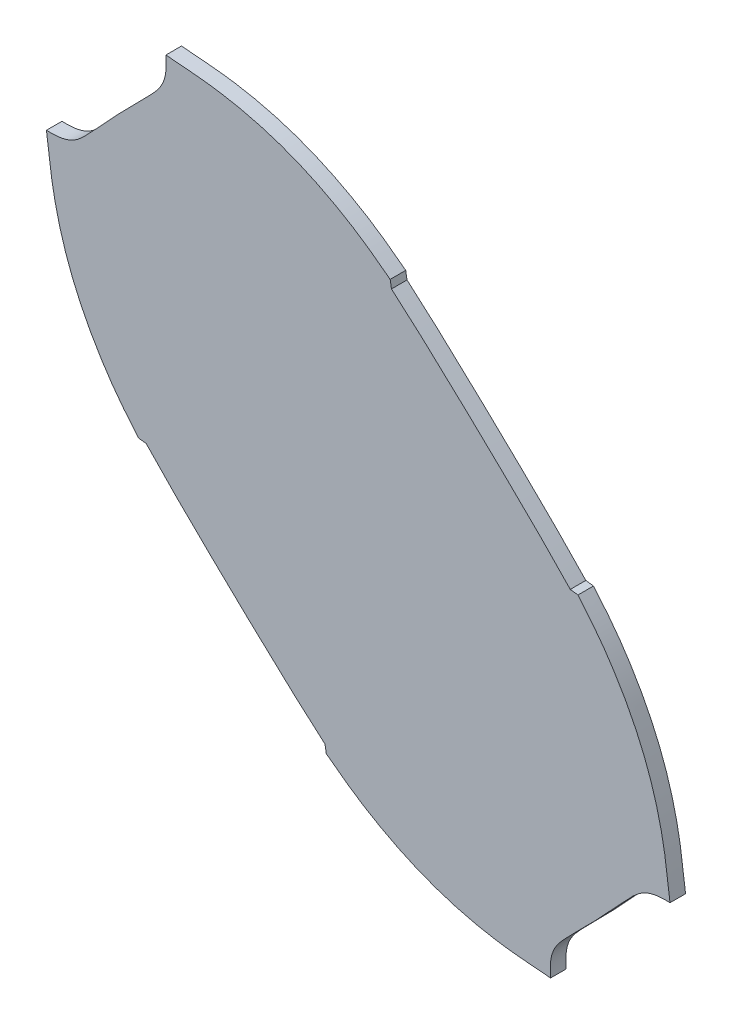
ISO-10303-21;
HEADER;
FILE_DESCRIPTION(('STEP AP214'),'2;1');
FILE_NAME('part.step','',(''),(''),'','','');
FILE_SCHEMA(('AUTOMOTIVE_DESIGN { 1 0 10303 214 1 1 1 1 }'));
ENDSEC;
DATA;
#1=APPLICATION_CONTEXT('core data for automotive mechanical design processes');
#2=APPLICATION_PROTOCOL_DEFINITION('international standard','automotive_design',2000,#1);
#3=PRODUCT_CONTEXT('',#1,'mechanical');
#4=PRODUCT('Part','Part','',(#3));
#5=PRODUCT_RELATED_PRODUCT_CATEGORY('part','',(#4));
#6=PRODUCT_DEFINITION_FORMATION('','',#4);
#7=PRODUCT_DEFINITION_CONTEXT('part definition',#1,'design');
#8=PRODUCT_DEFINITION('design','',#6,#7);
#9=PRODUCT_DEFINITION_SHAPE('','',#8);
#10=(LENGTH_UNIT() NAMED_UNIT(*) SI_UNIT(.MILLI.,.METRE.));
#11=(NAMED_UNIT(*) PLANE_ANGLE_UNIT() SI_UNIT($,.RADIAN.));
#12=(NAMED_UNIT(*) SI_UNIT($,.STERADIAN.) SOLID_ANGLE_UNIT());
#13=UNCERTAINTY_MEASURE_WITH_UNIT(LENGTH_MEASURE(1.E-05),#10,'distance_accuracy_value','');
#14=(GEOMETRIC_REPRESENTATION_CONTEXT(3) GLOBAL_UNCERTAINTY_ASSIGNED_CONTEXT((#13)) GLOBAL_UNIT_ASSIGNED_CONTEXT((#10,
#11,#12)) REPRESENTATION_CONTEXT('',''));
#15=CARTESIAN_POINT('',(0.,0.,0.));
#16=DIRECTION('',(0.,0.,1.));
#17=DIRECTION('',(1.,0.,0.));
#18=AXIS2_PLACEMENT_3D('',#15,#16,#17);
#19=CARTESIAN_POINT('',(2.67986765131261,-45.5572970029927,3.));
#20=DIRECTION('',(0.985966661338365,0.166942333544487,0.));
#21=DIRECTION('',(-0.166942333544487,0.985966661338365,0.));
#22=AXIS2_PLACEMENT_3D('',#19,#20,#21);
#23=PLANE('',#22);
#24=CARTESIAN_POINT('',(2.67986765131261,-45.5572970029927,0.));
#25=CARTESIAN_POINT('',(2.76331527435811,-46.0501412836728,0.));
#26=CARTESIAN_POINT('',(2.84676289740361,-46.5429855643529,0.));
#27=CARTESIAN_POINT('',(2.9302105204491,-47.035829845033,0.));
#28=B_SPLINE_CURVE_WITH_KNOTS('',3,(#24,#25,#26,#27),.UNSPECIFIED.,.F.,.F.,(4,4),(0.,1.),.UNSPECIFIED.);
#29=CARTESIAN_POINT('',(2.67986765131261,-45.5572970029927,0.));
#30=VERTEX_POINT('',#29);
#31=CARTESIAN_POINT('',(2.9302105204491,-47.035829845033,0.));
#32=VERTEX_POINT('',#31);
#33=EDGE_CURVE('E194',#30,#32,#28,.T.);
#34=ORIENTED_EDGE('',*,*,#33,.T.);
#35=DIRECTION('',(0.,0.,-1.));
#36=VECTOR('',#35,1.);
#37=CARTESIAN_POINT('',(2.9302105204491,-47.035829845033,3.));
#38=LINE('',#37,#36);
#39=CARTESIAN_POINT('',(2.9302105204491,-47.035829845033,3.));
#40=VERTEX_POINT('',#39);
#41=EDGE_CURVE('E11',#40,#32,#38,.T.);
#42=ORIENTED_EDGE('',*,*,#41,.F.);
#43=CARTESIAN_POINT('',(2.67986765131261,-45.5572970029927,3.));
#44=CARTESIAN_POINT('',(2.76331527435811,-46.0501412836728,3.));
#45=CARTESIAN_POINT('',(2.84676289740361,-46.5429855643529,3.));
#46=CARTESIAN_POINT('',(2.9302105204491,-47.035829845033,3.));
#47=B_SPLINE_CURVE_WITH_KNOTS('',3,(#43,#44,#45,#46),.UNSPECIFIED.,.F.,.F.,(4,4),(0.,1.),.UNSPECIFIED.);
#48=CARTESIAN_POINT('',(2.67986765131261,-45.5572970029927,3.));
#49=VERTEX_POINT('',#48);
#50=EDGE_CURVE('E435',#49,#40,#47,.T.);
#51=ORIENTED_EDGE('',*,*,#50,.F.);
#52=DIRECTION('',(0.,0.,-1.));
#53=VECTOR('',#52,1.);
#54=CARTESIAN_POINT('',(2.67986765131261,-45.5572970029927,3.));
#55=LINE('',#54,#53);
#56=EDGE_CURVE('E179',#49,#30,#55,.T.);
#57=ORIENTED_EDGE('',*,*,#56,.T.);
#58=EDGE_LOOP('',(#34,#42,#51,#57));
#59=FACE_BOUND('',#58,.T.);
#60=ADVANCED_FACE('F39',(#59),#23,.F.);
#61=CARTESIAN_POINT('',(2.9302105204491,-47.035829845033,3.));
#62=CARTESIAN_POINT('',(7.06739263392164,-50.2034087988623,3.));
#63=CARTESIAN_POINT('',(9.19210977284867,-51.6619495338041,3.));
#64=CARTESIAN_POINT('',(16.0339125247366,-55.5964176445261,3.));
#65=CARTESIAN_POINT('',(19.5317828946011,-57.2473779633906,3.));
#66=CARTESIAN_POINT('',(26.9017065758255,-59.9461433438054,3.));
#67=CARTESIAN_POINT('',(30.7298333587905,-60.9542798807845,3.));
#68=CARTESIAN_POINT('',(38.3297097036165,-62.2705019579,3.));
#69=CARTESIAN_POINT('',(40.9876039866022,-62.444811680781,3.));
#70=CARTESIAN_POINT('',(46.1803994232173,-62.8727567140036,3.));
#71=B_SPLINE_CURVE_WITH_KNOTS('',3,(#61,#62,#63,#64,#65,#66,#67,#68,#69,#70),.UNSPECIFIED.,.F.,
.F.,(4,2,2,2,4),(0.,0.25,0.5,0.75,1.),.UNSPECIFIED.);
#72=DIRECTION('',(0.,0.,-1.));
#73=VECTOR('',#72,1.);
#74=SURFACE_OF_LINEAR_EXTRUSION('',#71,#73);
#75=CARTESIAN_POINT('',(2.9302105204491,-47.035829845033,0.));
#76=CARTESIAN_POINT('',(7.06739263392164,-50.2034087988623,0.));
#77=CARTESIAN_POINT('',(9.19210977284867,-51.6619495338041,0.));
#78=CARTESIAN_POINT('',(16.0339125247366,-55.5964176445261,0.));
#79=CARTESIAN_POINT('',(19.5317828946011,-57.2473779633906,0.));
#80=CARTESIAN_POINT('',(26.9017065758255,-59.9461433438054,0.));
#81=CARTESIAN_POINT('',(30.7298333587905,-60.9542798807845,0.));
#82=CARTESIAN_POINT('',(38.3297097036165,-62.2705019579,0.));
#83=CARTESIAN_POINT('',(40.9876039866022,-62.444811680781,0.));
#84=CARTESIAN_POINT('',(46.1803994232173,-62.8727567140036,0.));
#85=B_SPLINE_CURVE_WITH_KNOTS('',3,(#75,#76,#77,#78,#79,#80,#81,#82,#83,#84),.UNSPECIFIED.,.F.,
.F.,(4,2,2,2,4),(0.,0.25,0.5,0.75,1.),.UNSPECIFIED.);
#86=CARTESIAN_POINT('',(46.1803994232173,-62.8727567140036,0.));
#87=VERTEX_POINT('',#86);
#88=EDGE_CURVE('E343',#32,#87,#85,.T.);
#89=ORIENTED_EDGE('',*,*,#88,.T.);
#90=DIRECTION('',(0.,0.,-1.));
#91=VECTOR('',#90,1.);
#92=CARTESIAN_POINT('',(46.1803994232173,-62.8727567140036,3.));
#93=LINE('',#92,#91);
#94=CARTESIAN_POINT('',(46.1803994232173,-62.8727567140036,3.));
#95=VERTEX_POINT('',#94);
#96=EDGE_CURVE('E47',#95,#87,#93,.T.);
#97=ORIENTED_EDGE('',*,*,#96,.F.);
#98=EDGE_CURVE('E122',#40,#95,#71,.T.);
#99=ORIENTED_EDGE('',*,*,#98,.F.);
#100=ORIENTED_EDGE('',*,*,#41,.T.);
#101=EDGE_LOOP('',(#89,#97,#99,#100));
#102=FACE_BOUND('',#101,.T.);
#103=ADVANCED_FACE('F461',(#102),#74,.F.);
#104=CARTESIAN_POINT('',(46.1803994232173,-62.8727567140036,3.));
#105=CARTESIAN_POINT('',(45.7588192219918,-57.6953537971166,3.));
#106=CARTESIAN_POINT('',(47.4255920559453,-56.517371281402,3.));
#107=CARTESIAN_POINT('',(51.0124658441758,-52.8226484741238,3.));
#108=B_SPLINE_CURVE_WITH_KNOTS('',3,(#104,#105,#106,#107),.UNSPECIFIED.,.F.,.F.,(4,4),(0.,1.),.UNSPECIFIED.);
#109=DIRECTION('',(0.,0.,-1.));
#110=VECTOR('',#109,1.);
#111=SURFACE_OF_LINEAR_EXTRUSION('',#108,#110);
#112=CARTESIAN_POINT('',(46.1803994232173,-62.8727567140036,0.));
#113=CARTESIAN_POINT('',(45.7588192219918,-57.6953537971166,0.));
#114=CARTESIAN_POINT('',(47.4255920559453,-56.517371281402,0.));
#115=CARTESIAN_POINT('',(51.0124658441758,-52.8226484741238,0.));
#116=B_SPLINE_CURVE_WITH_KNOTS('',3,(#112,#113,#114,#115),.UNSPECIFIED.,.F.,.F.,(4,4),(0.,1.),.UNSPECIFIED.);
#117=CARTESIAN_POINT('',(51.0124658441758,-52.8226484741238,0.));
#118=VERTEX_POINT('',#117);
#119=EDGE_CURVE('E338',#87,#118,#116,.T.);
#120=ORIENTED_EDGE('',*,*,#119,.T.);
#121=DIRECTION('',(0.,0.,-1.));
#122=VECTOR('',#121,1.);
#123=CARTESIAN_POINT('',(51.0124658441758,-52.8226484741238,3.));
#124=LINE('',#123,#122);
#125=CARTESIAN_POINT('',(51.0124658441758,-52.8226484741238,3.));
#126=VERTEX_POINT('',#125);
#127=EDGE_CURVE('E330',#126,#118,#124,.T.);
#128=ORIENTED_EDGE('',*,*,#127,.F.);
#129=EDGE_CURVE('E339',#95,#126,#108,.T.);
#130=ORIENTED_EDGE('',*,*,#129,.F.);
#131=ORIENTED_EDGE('',*,*,#96,.T.);
#132=EDGE_LOOP('',(#120,#128,#130,#131));
#133=FACE_BOUND('',#132,.T.);
#134=ADVANCED_FACE('F336',(#133),#111,.F.);
#135=CARTESIAN_POINT('',(51.0124658441758,-52.8226484741238,3.));
#136=CARTESIAN_POINT('',(54.8190457509373,-49.0037188838529,3.));
#137=CARTESIAN_POINT('',(55.7498454613234,-48.0270230841464,3.));
#138=CARTESIAN_POINT('',(59.3943023626721,-44.053029206688,3.));
#139=B_SPLINE_CURVE_WITH_KNOTS('',3,(#135,#136,#137,#138),.UNSPECIFIED.,.F.,.F.,(4,4),(0.,1.),.UNSPECIFIED.);
#140=DIRECTION('',(0.,0.,-1.));
#141=VECTOR('',#140,1.);
#142=SURFACE_OF_LINEAR_EXTRUSION('',#139,#141);
#143=CARTESIAN_POINT('',(51.0124658441758,-52.8226484741238,0.));
#144=CARTESIAN_POINT('',(54.8190457509373,-49.0037188838529,0.));
#145=CARTESIAN_POINT('',(55.7498454613234,-48.0270230841464,0.));
#146=CARTESIAN_POINT('',(59.3943023626721,-44.053029206688,0.));
#147=B_SPLINE_CURVE_WITH_KNOTS('',3,(#143,#144,#145,#146),.UNSPECIFIED.,.F.,.F.,(4,4),(0.,1.),.UNSPECIFIED.);
#148=CARTESIAN_POINT('',(59.3943023626721,-44.053029206688,0.));
#149=VERTEX_POINT('',#148);
#150=EDGE_CURVE('E345',#118,#149,#147,.T.);
#151=ORIENTED_EDGE('',*,*,#150,.T.);
#152=DIRECTION('',(0.,0.,-1.));
#153=VECTOR('',#152,1.);
#154=CARTESIAN_POINT('',(59.3943023626721,-44.053029206688,3.));
#155=LINE('',#154,#153);
#156=CARTESIAN_POINT('',(59.3943023626721,-44.053029206688,3.));
#157=VERTEX_POINT('',#156);
#158=EDGE_CURVE('E327',#157,#149,#155,.T.);
#159=ORIENTED_EDGE('',*,*,#158,.F.);
#160=EDGE_CURVE('E472',#126,#157,#139,.T.);
#161=ORIENTED_EDGE('',*,*,#160,.F.);
#162=ORIENTED_EDGE('',*,*,#127,.T.);
#163=EDGE_LOOP('',(#151,#159,#161,#162));
#164=FACE_BOUND('',#163,.T.);
#165=ADVANCED_FACE('F466',(#164),#142,.F.);
#166=CARTESIAN_POINT('',(59.3943023626721,-44.053029206688,3.));
#167=CARTESIAN_POINT('',(62.9224971678034,-40.306572327757,3.));
#168=CARTESIAN_POINT('',(64.0272323538126,-38.5917467058987,3.));
#169=CARTESIAN_POINT('',(69.2151476886286,-38.7865529583855,3.));
#170=B_SPLINE_CURVE_WITH_KNOTS('',3,(#166,#167,#168,#169),.UNSPECIFIED.,.F.,.F.,(4,4),(0.,1.),.UNSPECIFIED.);
#171=DIRECTION('',(0.,0.,-1.));
#172=VECTOR('',#171,1.);
#173=SURFACE_OF_LINEAR_EXTRUSION('',#170,#172);
#174=CARTESIAN_POINT('',(59.3943023626721,-44.053029206688,0.));
#175=CARTESIAN_POINT('',(62.9224971678034,-40.306572327757,0.));
#176=CARTESIAN_POINT('',(64.0272323538126,-38.5917467058987,0.));
#177=CARTESIAN_POINT('',(69.2151476886286,-38.7865529583855,0.));
#178=B_SPLINE_CURVE_WITH_KNOTS('',3,(#174,#175,#176,#177),.UNSPECIFIED.,.F.,.F.,(4,4),(0.,1.),.UNSPECIFIED.);
#179=CARTESIAN_POINT('',(69.2151476886286,-38.7865529583855,0.));
#180=VERTEX_POINT('',#179);
#181=EDGE_CURVE('E347',#149,#180,#178,.T.);
#182=ORIENTED_EDGE('',*,*,#181,.T.);
#183=DIRECTION('',(0.,0.,-1.));
#184=VECTOR('',#183,1.);
#185=CARTESIAN_POINT('',(69.2151476886286,-38.7865529583855,3.));
#186=LINE('',#185,#184);
#187=CARTESIAN_POINT('',(69.2151476886286,-38.7865529583855,3.));
#188=VERTEX_POINT('',#187);
#189=EDGE_CURVE('E324',#188,#180,#186,.T.);
#190=ORIENTED_EDGE('',*,*,#189,.F.);
#191=EDGE_CURVE('E476',#157,#188,#170,.T.);
#192=ORIENTED_EDGE('',*,*,#191,.F.);
#193=ORIENTED_EDGE('',*,*,#158,.T.);
#194=EDGE_LOOP('',(#182,#190,#192,#193));
#195=FACE_BOUND('',#194,.T.);
#196=ADVANCED_FACE('F469',(#195),#173,.F.);
#197=CARTESIAN_POINT('',(69.2151476886286,-38.7865529583855,3.));
#198=CARTESIAN_POINT('',(68.5598232726912,-33.6140499710575,3.));
#199=CARTESIAN_POINT('',(68.2875291156745,-31.0569788599718,3.));
#200=CARTESIAN_POINT('',(66.5948826496287,-23.3333519592148,3.));
#201=CARTESIAN_POINT('',(65.4269385769879,-19.6168737524774,3.));
#202=CARTESIAN_POINT('',(62.4271748159761,-12.4205633123215,3.));
#203=CARTESIAN_POINT('',(60.576503980728,-8.91475204826948,3.));
#204=CARTESIAN_POINT('',(56.4107520143556,-2.35971415168643,3.));
#205=CARTESIAN_POINT('',(54.82295045455,-0.246005975862343,3.));
#206=CARTESIAN_POINT('',(51.4665365820814,3.74383768552804,3.));
#207=B_SPLINE_CURVE_WITH_KNOTS('',3,(#197,#198,#199,#200,#201,#202,#203,#204,#205,#206),
.UNSPECIFIED.,.F.,.F.,(4,2,2,2,4),(0.,0.25,0.5,0.75,1.),.UNSPECIFIED.);
#208=DIRECTION('',(0.,0.,-1.));
#209=VECTOR('',#208,1.);
#210=SURFACE_OF_LINEAR_EXTRUSION('',#207,#209);
#211=CARTESIAN_POINT('',(69.2151476886286,-38.7865529583855,0.));
#212=CARTESIAN_POINT('',(68.5598232726912,-33.6140499710575,0.));
#213=CARTESIAN_POINT('',(68.2875291156745,-31.0569788599718,0.));
#214=CARTESIAN_POINT('',(66.5948826496287,-23.3333519592148,0.));
#215=CARTESIAN_POINT('',(65.4269385769879,-19.6168737524774,0.));
#216=CARTESIAN_POINT('',(62.4271748159761,-12.4205633123215,0.));
#217=CARTESIAN_POINT('',(60.576503980728,-8.91475204826948,0.));
#218=CARTESIAN_POINT('',(56.4107520143556,-2.35971415168643,0.));
#219=CARTESIAN_POINT('',(54.82295045455,-0.246005975862343,0.));
#220=CARTESIAN_POINT('',(51.4665365820814,3.74383768552804,0.));
#221=B_SPLINE_CURVE_WITH_KNOTS('',3,(#211,#212,#213,#214,#215,#216,#217,#218,#219,#220),
.UNSPECIFIED.,.F.,.F.,(4,2,2,2,4),(0.,0.25,0.5,0.75,1.),.UNSPECIFIED.);
#222=CARTESIAN_POINT('',(51.4665365820814,3.74383768552804,0.));
#223=VERTEX_POINT('',#222);
#224=EDGE_CURVE('E365',#180,#223,#221,.T.);
#225=ORIENTED_EDGE('',*,*,#224,.T.);
#226=DIRECTION('',(0.,0.,-1.));
#227=VECTOR('',#226,1.);
#228=CARTESIAN_POINT('',(51.4665365820814,3.74383768552804,3.));
#229=LINE('',#228,#227);
#230=CARTESIAN_POINT('',(51.4665365820814,3.74383768552804,3.));
#231=VERTEX_POINT('',#230);
#232=EDGE_CURVE('E321',#231,#223,#229,.T.);
#233=ORIENTED_EDGE('',*,*,#232,.F.);
#234=EDGE_CURVE('E483',#188,#231,#207,.T.);
#235=ORIENTED_EDGE('',*,*,#234,.F.);
#236=ORIENTED_EDGE('',*,*,#189,.T.);
#237=EDGE_LOOP('',(#225,#233,#235,#236));
#238=FACE_BOUND('',#237,.T.);
#239=ADVANCED_FACE('F493',(#238),#210,.F.);
#240=CARTESIAN_POINT('',(51.4665365820814,3.74383768552804,3.));
#241=DIRECTION('',(-0.121691514294765,-0.992567970140407,0.));
#242=DIRECTION('',(0.992567970140407,-0.121691514294765,0.));
#243=AXIS2_PLACEMENT_3D('',#240,#241,#242);
#244=PLANE('',#243);
#245=CARTESIAN_POINT('',(51.4665365820814,3.74383768552804,0.));
#246=CARTESIAN_POINT('',(50.9703308994542,3.8046736746698,0.));
#247=CARTESIAN_POINT('',(50.4741252168269,3.86550966381156,0.));
#248=CARTESIAN_POINT('',(49.9779189973266,3.92634622251922,0.));
#249=B_SPLINE_CURVE_WITH_KNOTS('',3,(#245,#246,#247,#248),.UNSPECIFIED.,.F.,.F.,(4,4),(0.,1.),.UNSPECIFIED.);
#250=CARTESIAN_POINT('',(49.9779189973266,3.92634622251922,0.));
#251=VERTEX_POINT('',#250);
#252=EDGE_CURVE('E372',#223,#251,#249,.T.);
#253=ORIENTED_EDGE('',*,*,#252,.T.);
#254=DIRECTION('',(0.,0.,-1.));
#255=VECTOR('',#254,1.);
#256=CARTESIAN_POINT('',(49.9779189973266,3.92634622251922,3.));
#257=LINE('',#256,#255);
#258=CARTESIAN_POINT('',(49.9779189973266,3.92634622251922,3.));
#259=VERTEX_POINT('',#258);
#260=EDGE_CURVE('E318',#259,#251,#257,.T.);
#261=ORIENTED_EDGE('',*,*,#260,.F.);
#262=CARTESIAN_POINT('',(51.4665365820814,3.74383768552804,3.));
#263=CARTESIAN_POINT('',(50.9703308994542,3.8046736746698,3.));
#264=CARTESIAN_POINT('',(50.4741252168269,3.86550966381156,3.));
#265=CARTESIAN_POINT('',(49.9779189973266,3.92634622251922,3.));
#266=B_SPLINE_CURVE_WITH_KNOTS('',3,(#262,#263,#264,#265),.UNSPECIFIED.,.F.,.F.,(4,4),(0.,1.),.UNSPECIFIED.);
#267=EDGE_CURVE('E271',#231,#259,#266,.T.);
#268=ORIENTED_EDGE('',*,*,#267,.F.);
#269=ORIENTED_EDGE('',*,*,#232,.T.);
#270=EDGE_LOOP('',(#253,#261,#268,#269));
#271=FACE_BOUND('',#270,.T.);
#272=ADVANCED_FACE('F262',(#271),#244,.F.);
#273=CARTESIAN_POINT('',(49.9779189973266,3.92634622251922,3.));
#274=CARTESIAN_POINT('',(46.3422027267779,7.78345872024768,3.));
#275=CARTESIAN_POINT('',(44.2984187794105,9.7971699056581,3.));
#276=CARTESIAN_POINT('',(38.9488273814404,15.0753740533966,3.));
#277=CARTESIAN_POINT('',(35.9880801165193,17.9433286031112,3.));
#278=CARTESIAN_POINT('',(30.1361710619883,23.5338726794479,3.));
#279=CARTESIAN_POINT('',(27.4092473261903,26.1078768234997,3.));
#280=CARTESIAN_POINT('',(21.3457678722633,31.7162268395687,3.));
#281=CARTESIAN_POINT('',(19.5152881179083,33.4146585646661,3.));
#282=CARTESIAN_POINT('',(15.4936110731667,36.8674803577092,3.));
#283=B_SPLINE_CURVE_WITH_KNOTS('',3,(#273,#274,#275,#276,#277,#278,#279,#280,#281,#282),
.UNSPECIFIED.,.F.,.F.,(4,2,2,2,4),(0.,0.25,0.5,0.75,1.),.UNSPECIFIED.);
#284=DIRECTION('',(0.,0.,-1.));
#285=VECTOR('',#284,1.);
#286=SURFACE_OF_LINEAR_EXTRUSION('',#283,#285);
#287=CARTESIAN_POINT('',(49.9779189973266,3.92634622251922,0.));
#288=CARTESIAN_POINT('',(46.3422027267779,7.78345872024768,0.));
#289=CARTESIAN_POINT('',(44.2984187794105,9.7971699056581,0.));
#290=CARTESIAN_POINT('',(38.9488273814404,15.0753740533966,0.));
#291=CARTESIAN_POINT('',(35.9880801165193,17.9433286031112,0.));
#292=CARTESIAN_POINT('',(30.1361710619883,23.5338726794479,0.));
#293=CARTESIAN_POINT('',(27.4092473261903,26.1078768234997,0.));
#294=CARTESIAN_POINT('',(21.3457678722633,31.7162268395687,0.));
#295=CARTESIAN_POINT('',(19.5152881179083,33.4146585646661,0.));
#296=CARTESIAN_POINT('',(15.4936110731667,36.8674803577092,0.));
#297=B_SPLINE_CURVE_WITH_KNOTS('',3,(#287,#288,#289,#290,#291,#292,#293,#294,#295,#296),
.UNSPECIFIED.,.F.,.F.,(4,2,2,2,4),(0.,0.25,0.5,0.75,1.),.UNSPECIFIED.);
#298=CARTESIAN_POINT('',(15.4936110731667,36.8674803577092,0.));
#299=VERTEX_POINT('',#298);
#300=EDGE_CURVE('E379',#251,#299,#297,.T.);
#301=ORIENTED_EDGE('',*,*,#300,.T.);
#302=DIRECTION('',(0.,0.,-1.));
#303=VECTOR('',#302,1.);
#304=CARTESIAN_POINT('',(15.4936110731667,36.8674803577092,3.));
#305=LINE('',#304,#303);
#306=CARTESIAN_POINT('',(15.4936110731667,36.8674803577092,3.));
#307=VERTEX_POINT('',#306);
#308=EDGE_CURVE('E315',#307,#299,#305,.T.);
#309=ORIENTED_EDGE('',*,*,#308,.F.);
#310=EDGE_CURVE('E265',#259,#307,#283,.T.);
#311=ORIENTED_EDGE('',*,*,#310,.F.);
#312=ORIENTED_EDGE('',*,*,#260,.T.);
#313=EDGE_LOOP('',(#301,#309,#311,#312));
#314=FACE_BOUND('',#313,.T.);
#315=ADVANCED_FACE('F257',(#314),#286,.F.);
#316=CARTESIAN_POINT('',(15.4936110731667,36.8674803577092,3.));
#317=DIRECTION('',(-0.986075299622289,-0.166299439189712,0.));
#318=DIRECTION('',(0.166299439189712,-0.986075299622289,0.));
#319=AXIS2_PLACEMENT_3D('',#316,#317,#318);
#320=PLANE('',#319);
#321=CARTESIAN_POINT('',(15.4936110731667,36.8674803577092,0.));
#322=CARTESIAN_POINT('',(15.4105479331222,37.3600056348401,0.));
#323=CARTESIAN_POINT('',(15.3274847930777,37.8525309119709,0.));
#324=CARTESIAN_POINT('',(15.2444210707309,38.3450566352479,0.));
#325=B_SPLINE_CURVE_WITH_KNOTS('',3,(#321,#322,#323,#324),.UNSPECIFIED.,.F.,.F.,(4,4),(0.,1.),.UNSPECIFIED.);
#326=CARTESIAN_POINT('',(15.2444210707309,38.3450566352479,0.));
#327=VERTEX_POINT('',#326);
#328=EDGE_CURVE('E386',#299,#327,#325,.T.);
#329=ORIENTED_EDGE('',*,*,#328,.T.);
#330=DIRECTION('',(0.,0.,-1.));
#331=VECTOR('',#330,1.);
#332=CARTESIAN_POINT('',(15.2444210707309,38.3450566352479,3.));
#333=LINE('',#332,#331);
#334=CARTESIAN_POINT('',(15.2444210707309,38.3450566352479,3.));
#335=VERTEX_POINT('',#334);
#336=EDGE_CURVE('E295',#335,#327,#333,.T.);
#337=ORIENTED_EDGE('',*,*,#336,.F.);
#338=CARTESIAN_POINT('',(15.4936110731667,36.8674803577092,3.));
#339=CARTESIAN_POINT('',(15.4105479331222,37.3600056348401,3.));
#340=CARTESIAN_POINT('',(15.3274847930777,37.8525309119709,3.));
#341=CARTESIAN_POINT('',(15.2444210707309,38.3450566352479,3.));
#342=B_SPLINE_CURVE_WITH_KNOTS('',3,(#338,#339,#340,#341),.UNSPECIFIED.,.F.,.F.,(4,4),(0.,1.),.UNSPECIFIED.);
#343=EDGE_CURVE('E270',#307,#335,#342,.T.);
#344=ORIENTED_EDGE('',*,*,#343,.F.);
#345=ORIENTED_EDGE('',*,*,#308,.T.);
#346=EDGE_LOOP('',(#329,#337,#344,#345));
#347=FACE_BOUND('',#346,.T.);
#348=ADVANCED_FACE('F253',(#347),#320,.F.);
#349=CARTESIAN_POINT('',(15.2444210707309,38.3450566352479,3.));
#350=CARTESIAN_POINT('',(11.1081873745204,41.5141403609123,3.));
#351=CARTESIAN_POINT('',(8.98478910546533,42.9760440635204,3.));
#352=CARTESIAN_POINT('',(2.14537045637109,46.9121958427985,3.));
#353=CARTESIAN_POINT('',(-1.35312430932713,48.5643838161071,3.));
#354=CARTESIAN_POINT('',(-8.72234932244232,51.2646249486346,3.));
#355=CARTESIAN_POINT('',(-12.5509030206685,52.2736394916465,3.));
#356=CARTESIAN_POINT('',(-20.1501038377314,53.5915598243394,3.));
#357=CARTESIAN_POINT('',(-22.8083585341831,53.7663649566337,3.));
#358=CARTESIAN_POINT('',(-28.0010985369915,54.1970414531121,3.));
#359=B_SPLINE_CURVE_WITH_KNOTS('',3,(#349,#350,#351,#352,#353,#354,#355,#356,#357,#358),
.UNSPECIFIED.,.F.,.F.,(4,2,2,2,4),(0.,0.25,0.5,0.75,1.),.UNSPECIFIED.);
#360=DIRECTION('',(0.,0.,-1.));
#361=VECTOR('',#360,1.);
#362=SURFACE_OF_LINEAR_EXTRUSION('',#359,#361);
#363=CARTESIAN_POINT('',(15.2444210707309,38.3450566352479,0.));
#364=CARTESIAN_POINT('',(11.1081873745204,41.5141403609123,0.));
#365=CARTESIAN_POINT('',(8.98478910546533,42.9760440635204,0.));
#366=CARTESIAN_POINT('',(2.14537045637109,46.9121958427985,0.));
#367=CARTESIAN_POINT('',(-1.35312430932713,48.5643838161071,0.));
#368=CARTESIAN_POINT('',(-8.72234932244232,51.2646249486346,0.));
#369=CARTESIAN_POINT('',(-12.5509030206685,52.2736394916465,0.));
#370=CARTESIAN_POINT('',(-20.1501038377314,53.5915598243394,0.));
#371=CARTESIAN_POINT('',(-22.8083585341831,53.7663649566337,0.));
#372=CARTESIAN_POINT('',(-28.0010985369915,54.1970414531121,0.));
#373=B_SPLINE_CURVE_WITH_KNOTS('',3,(#363,#364,#365,#366,#367,#368,#369,#370,#371,#372),
.UNSPECIFIED.,.F.,.F.,(4,2,2,2,4),(0.,0.25,0.5,0.75,1.),.UNSPECIFIED.);
#374=CARTESIAN_POINT('',(-28.0010985369915,54.1970414531121,0.));
#375=VERTEX_POINT('',#374);
#376=EDGE_CURVE('E293',#327,#375,#373,.T.);
#377=ORIENTED_EDGE('',*,*,#376,.T.);
#378=DIRECTION('',(0.,0.,-1.));
#379=VECTOR('',#378,1.);
#380=CARTESIAN_POINT('',(-28.0010985369915,54.1970414531121,3.));
#381=LINE('',#380,#379);
#382=CARTESIAN_POINT('',(-28.0010985369915,54.1970414531121,3.));
#383=VERTEX_POINT('',#382);
#384=EDGE_CURVE('E291',#383,#375,#381,.T.);
#385=ORIENTED_EDGE('',*,*,#384,.F.);
#386=EDGE_CURVE('E238',#335,#383,#359,.T.);
#387=ORIENTED_EDGE('',*,*,#386,.F.);
#388=ORIENTED_EDGE('',*,*,#336,.T.);
#389=EDGE_LOOP('',(#377,#385,#387,#388));
#390=FACE_BOUND('',#389,.T.);
#391=ADVANCED_FACE('F249',(#390),#362,.F.);
#392=CARTESIAN_POINT('',(-28.0010985369915,54.1970414531121,3.));
#393=CARTESIAN_POINT('',(-27.582231732883,49.0179721556822,3.));
#394=CARTESIAN_POINT('',(-29.2506063151397,47.8410299041061,3.));
#395=CARTESIAN_POINT('',(-32.8393479000937,44.1461284143244,3.));
#396=B_SPLINE_CURVE_WITH_KNOTS('',3,(#392,#393,#394,#395),.UNSPECIFIED.,.F.,.F.,(4,4),(0.,1.),.UNSPECIFIED.);
#397=DIRECTION('',(0.,0.,-1.));
#398=VECTOR('',#397,1.);
#399=SURFACE_OF_LINEAR_EXTRUSION('',#396,#398);
#400=CARTESIAN_POINT('',(-28.0010985369915,54.1970414531121,0.));
#401=CARTESIAN_POINT('',(-27.582231732883,49.0179721556822,0.));
#402=CARTESIAN_POINT('',(-29.2506063151397,47.8410299041061,0.));
#403=CARTESIAN_POINT('',(-32.8393479000937,44.1461284143244,0.));
#404=B_SPLINE_CURVE_WITH_KNOTS('',3,(#400,#401,#402,#403),.UNSPECIFIED.,.F.,.F.,(4,4),(0.,1.),.UNSPECIFIED.);
#405=CARTESIAN_POINT('',(-32.8393479000937,44.1461284143244,0.));
#406=VERTEX_POINT('',#405);
#407=EDGE_CURVE('E300',#375,#406,#404,.T.);
#408=ORIENTED_EDGE('',*,*,#407,.T.);
#409=DIRECTION('',(0.,0.,-1.));
#410=VECTOR('',#409,1.);
#411=CARTESIAN_POINT('',(-32.8393479000937,44.1461284143244,3.));
#412=LINE('',#411,#410);
#413=CARTESIAN_POINT('',(-32.8393479000937,44.1461284143244,3.));
#414=VERTEX_POINT('',#413);
#415=EDGE_CURVE('E296',#414,#406,#412,.T.);
#416=ORIENTED_EDGE('',*,*,#415,.F.);
#417=EDGE_CURVE('E230',#383,#414,#396,.T.);
#418=ORIENTED_EDGE('',*,*,#417,.F.);
#419=ORIENTED_EDGE('',*,*,#384,.T.);
#420=EDGE_LOOP('',(#408,#416,#418,#419));
#421=FACE_BOUND('',#420,.T.);
#422=ADVANCED_FACE('F246',(#421),#399,.F.);
#423=CARTESIAN_POINT('',(-32.8393479000937,44.1461284143244,3.));
#424=CARTESIAN_POINT('',(-36.6475249864887,40.3266305554171,3.));
#425=CARTESIAN_POINT('',(-37.5784693482079,39.3495289560622,3.));
#426=CARTESIAN_POINT('',(-41.2240350047027,35.3744743362338,3.));
#427=B_SPLINE_CURVE_WITH_KNOTS('',3,(#423,#424,#425,#426),.UNSPECIFIED.,.F.,.F.,(4,4),(0.,1.),.UNSPECIFIED.);
#428=DIRECTION('',(0.,0.,-1.));
#429=VECTOR('',#428,1.);
#430=SURFACE_OF_LINEAR_EXTRUSION('',#427,#429);
#431=CARTESIAN_POINT('',(-32.8393479000937,44.1461284143244,0.));
#432=CARTESIAN_POINT('',(-36.6475249864887,40.3266305554171,0.));
#433=CARTESIAN_POINT('',(-37.5784693482079,39.3495289560622,0.));
#434=CARTESIAN_POINT('',(-41.2240350047027,35.3744743362338,0.));
#435=B_SPLINE_CURVE_WITH_KNOTS('',3,(#431,#432,#433,#434),.UNSPECIFIED.,.F.,.F.,(4,4),(0.,1.),.UNSPECIFIED.);
#436=CARTESIAN_POINT('',(-41.2240350047027,35.3744743362338,0.));
#437=VERTEX_POINT('',#436);
#438=EDGE_CURVE('E307',#406,#437,#435,.T.);
#439=ORIENTED_EDGE('',*,*,#438,.T.);
#440=DIRECTION('',(0.,0.,-1.));
#441=VECTOR('',#440,1.);
#442=CARTESIAN_POINT('',(-41.2240350047027,35.3744743362338,3.));
#443=LINE('',#442,#441);
#444=CARTESIAN_POINT('',(-41.2240350047027,35.3744743362338,3.));
#445=VERTEX_POINT('',#444);
#446=EDGE_CURVE('E303',#445,#437,#443,.T.);
#447=ORIENTED_EDGE('',*,*,#446,.F.);
#448=EDGE_CURVE('E222',#414,#445,#427,.T.);
#449=ORIENTED_EDGE('',*,*,#448,.F.);
#450=ORIENTED_EDGE('',*,*,#415,.T.);
#451=EDGE_LOOP('',(#439,#447,#449,#450));
#452=FACE_BOUND('',#451,.T.);
#453=ADVANCED_FACE('F215',(#452),#430,.F.);
#454=CARTESIAN_POINT('',(-41.2240350047027,35.3744743362338,3.));
#455=CARTESIAN_POINT('',(-44.7525410093212,31.6269526398398,3.));
#456=CARTESIAN_POINT('',(-45.8569019736836,29.9111712203924,3.));
#457=CARTESIAN_POINT('',(-51.0458584144482,30.10504383373,3.));
#458=B_SPLINE_CURVE_WITH_KNOTS('',3,(#454,#455,#456,#457),.UNSPECIFIED.,.F.,.F.,(4,4),(0.,1.),.UNSPECIFIED.);
#459=DIRECTION('',(0.,0.,-1.));
#460=VECTOR('',#459,1.);
#461=SURFACE_OF_LINEAR_EXTRUSION('',#458,#460);
#462=CARTESIAN_POINT('',(-41.2240350047027,35.3744743362338,0.));
#463=CARTESIAN_POINT('',(-44.7525410093212,31.6269526398398,0.));
#464=CARTESIAN_POINT('',(-45.8569019736836,29.9111712203924,0.));
#465=CARTESIAN_POINT('',(-51.0458584144482,30.10504383373,0.));
#466=B_SPLINE_CURVE_WITH_KNOTS('',3,(#462,#463,#464,#465),.UNSPECIFIED.,.F.,.F.,(4,4),(0.,1.),.UNSPECIFIED.);
#467=CARTESIAN_POINT('',(-51.0458584144482,30.10504383373,0.));
#468=VERTEX_POINT('',#467);
#469=EDGE_CURVE('E310',#437,#468,#466,.T.);
#470=ORIENTED_EDGE('',*,*,#469,.T.);
#471=DIRECTION('',(0.,0.,-1.));
#472=VECTOR('',#471,1.);
#473=CARTESIAN_POINT('',(-51.0458584144482,30.10504383373,3.));
#474=LINE('',#473,#472);
#475=CARTESIAN_POINT('',(-51.0458584144482,30.10504383373,3.));
#476=VERTEX_POINT('',#475);
#477=EDGE_CURVE('E174',#476,#468,#474,.T.);
#478=ORIENTED_EDGE('',*,*,#477,.F.);
#479=EDGE_CURVE('E165',#445,#476,#458,.T.);
#480=ORIENTED_EDGE('',*,*,#479,.F.);
#481=ORIENTED_EDGE('',*,*,#446,.T.);
#482=EDGE_LOOP('',(#470,#478,#480,#481));
#483=FACE_BOUND('',#482,.T.);
#484=ADVANCED_FACE('F212',(#483),#461,.F.);
#485=CARTESIAN_POINT('',(-51.0458584144482,30.10504383373,3.));
#486=CARTESIAN_POINT('',(-50.3895797882172,24.932244900762,3.));
#487=CARTESIAN_POINT('',(-50.1174221708761,22.3750642198628,3.));
#488=CARTESIAN_POINT('',(-48.4245725992088,14.6506184869699,3.));
#489=CARTESIAN_POINT('',(-47.2566611758192,10.9340493520748,3.));
#490=CARTESIAN_POINT('',(-44.2564862195362,3.73696883200081,3.));
#491=CARTESIAN_POINT('',(-42.4063156105294,0.232073047638316,3.));
#492=CARTESIAN_POINT('',(-38.2379292873778,-6.32500722013493,3.));
#493=CARTESIAN_POINT('',(-36.6488251550715,-8.43643295887349,3.));
#494=CARTESIAN_POINT('',(-33.2912649906014,-12.4258537123733,3.));
#495=B_SPLINE_CURVE_WITH_KNOTS('',3,(#485,#486,#487,#488,#489,#490,#491,#492,#493,#494),
.UNSPECIFIED.,.F.,.F.,(4,2,2,2,4),(0.,0.25,0.5,0.75,1.),.UNSPECIFIED.);
#496=DIRECTION('',(0.,0.,-1.));
#497=VECTOR('',#496,1.);
#498=SURFACE_OF_LINEAR_EXTRUSION('',#495,#497);
#499=CARTESIAN_POINT('',(-51.0458584144482,30.10504383373,0.));
#500=CARTESIAN_POINT('',(-50.3895797882172,24.932244900762,0.));
#501=CARTESIAN_POINT('',(-50.1174221708761,22.3750642198628,0.));
#502=CARTESIAN_POINT('',(-48.4245725992088,14.6506184869699,0.));
#503=CARTESIAN_POINT('',(-47.2566611758192,10.9340493520748,0.));
#504=CARTESIAN_POINT('',(-44.2564862195362,3.73696883200081,0.));
#505=CARTESIAN_POINT('',(-42.4063156105294,0.232073047638316,0.));
#506=CARTESIAN_POINT('',(-38.2379292873778,-6.32500722013493,0.));
#507=CARTESIAN_POINT('',(-36.6488251550715,-8.43643295887349,0.));
#508=CARTESIAN_POINT('',(-33.2912649906014,-12.4258537123733,0.));
#509=B_SPLINE_CURVE_WITH_KNOTS('',3,(#499,#500,#501,#502,#503,#504,#505,#506,#507,#508),
.UNSPECIFIED.,.F.,.F.,(4,2,2,2,4),(0.,0.25,0.5,0.75,1.),.UNSPECIFIED.);
#510=CARTESIAN_POINT('',(-33.2912649906014,-12.4258537123733,0.));
#511=VERTEX_POINT('',#510);
#512=EDGE_CURVE('E173',#468,#511,#509,.T.);
#513=ORIENTED_EDGE('',*,*,#512,.T.);
#514=DIRECTION('',(0.,0.,-1.));
#515=VECTOR('',#514,1.);
#516=CARTESIAN_POINT('',(-33.2912649906014,-12.4258537123733,3.));
#517=LINE('',#516,#515);
#518=CARTESIAN_POINT('',(-33.2912649906014,-12.4258537123733,3.));
#519=VERTEX_POINT('',#518);
#520=EDGE_CURVE('E170',#519,#511,#517,.T.);
#521=ORIENTED_EDGE('',*,*,#520,.F.);
#522=EDGE_CURVE('E159',#476,#519,#495,.T.);
#523=ORIENTED_EDGE('',*,*,#522,.F.);
#524=ORIENTED_EDGE('',*,*,#477,.T.);
#525=EDGE_LOOP('',(#513,#521,#523,#524));
#526=FACE_BOUND('',#525,.T.);
#527=ADVANCED_FACE('F171',(#526),#498,.F.);
#528=CARTESIAN_POINT('',(-33.2912649906014,-12.4258537123733,3.));
#529=DIRECTION('',(0.12031788949479,0.992735415640804,0.));
#530=DIRECTION('',(-0.992735415640804,0.12031788949479,0.));
#531=AXIS2_PLACEMENT_3D('',#528,#529,#530);
#532=PLANE('',#531);
#533=CARTESIAN_POINT('',(-33.2912649906014,-12.4258537123733,0.));
#534=CARTESIAN_POINT('',(-32.7955075368495,-12.4859385274513,0.));
#535=CARTESIAN_POINT('',(-32.2997500830976,-12.5460233425292,0.));
#536=CARTESIAN_POINT('',(-31.8039920941565,-12.60610872613,0.));
#537=B_SPLINE_CURVE_WITH_KNOTS('',3,(#533,#534,#535,#536),.UNSPECIFIED.,.F.,.F.,(4,4),(0.,1.),.UNSPECIFIED.);
#538=CARTESIAN_POINT('',(-31.8039920941565,-12.60610872613,0.));
#539=VERTEX_POINT('',#538);
#540=EDGE_CURVE('E108',#511,#539,#537,.T.);
#541=ORIENTED_EDGE('',*,*,#540,.T.);
#542=DIRECTION('',(0.,0.,-1.));
#543=VECTOR('',#542,1.);
#544=CARTESIAN_POINT('',(-31.8039920941565,-12.60610872613,3.));
#545=LINE('',#544,#543);
#546=CARTESIAN_POINT('',(-31.8039920941565,-12.60610872613,3.));
#547=VERTEX_POINT('',#546);
#548=EDGE_CURVE('E175',#547,#539,#545,.T.);
#549=ORIENTED_EDGE('',*,*,#548,.F.);
#550=CARTESIAN_POINT('',(-33.2912649906014,-12.4258537123733,3.));
#551=CARTESIAN_POINT('',(-32.7955075368495,-12.4859385274513,3.));
#552=CARTESIAN_POINT('',(-32.2997500830976,-12.5460233425292,3.));
#553=CARTESIAN_POINT('',(-31.8039920941565,-12.60610872613,3.));
#554=B_SPLINE_CURVE_WITH_KNOTS('',3,(#550,#551,#552,#553),.UNSPECIFIED.,.F.,.F.,(4,4),(0.,1.),.UNSPECIFIED.);
#555=EDGE_CURVE('E163',#519,#547,#554,.T.);
#556=ORIENTED_EDGE('',*,*,#555,.F.);
#557=ORIENTED_EDGE('',*,*,#520,.T.);
#558=EDGE_LOOP('',(#541,#549,#556,#557));
#559=FACE_BOUND('',#558,.T.);
#560=ADVANCED_FACE('F177',(#559),#532,.F.);
#561=CARTESIAN_POINT('',(-31.8039920941565,-12.60610872613,3.));
#562=CARTESIAN_POINT('',(-28.1702790162171,-16.4661439205647,3.));
#563=CARTESIAN_POINT('',(-26.1266232016681,-18.477365459375,3.));
#564=CARTESIAN_POINT('',(-20.7738896044376,-23.7604593881377,3.));
#565=CARTESIAN_POINT('',(-17.8160097113815,-26.6268046646043,3.));
#566=CARTESIAN_POINT('',(-11.962306890964,-32.2213238101771,3.));
#567=CARTESIAN_POINT('',(-9.23631695167381,-34.7954817864968,3.));
#568=CARTESIAN_POINT('',(-3.17339665373455,-40.4051172286894,3.));
#569=CARTESIAN_POINT('',(-1.34312771406844,-42.1048599198778,3.));
#570=CARTESIAN_POINT('',(2.67986765131261,-45.5572970029927,3.));
#571=B_SPLINE_CURVE_WITH_KNOTS('',3,(#561,#562,#563,#564,#565,#566,#567,#568,#569,#570),
.UNSPECIFIED.,.F.,.F.,(4,2,2,2,4),(0.,0.25,0.5,0.75,1.),.UNSPECIFIED.);
#572=DIRECTION('',(0.,0.,-1.));
#573=VECTOR('',#572,1.);
#574=SURFACE_OF_LINEAR_EXTRUSION('',#571,#573);
#575=CARTESIAN_POINT('',(-31.8039920941565,-12.60610872613,0.));
#576=CARTESIAN_POINT('',(-28.1702790162171,-16.4661439205647,0.));
#577=CARTESIAN_POINT('',(-26.1266232016681,-18.477365459375,0.));
#578=CARTESIAN_POINT('',(-20.7738896044376,-23.7604593881377,0.));
#579=CARTESIAN_POINT('',(-17.8160097113815,-26.6268046646043,0.));
#580=CARTESIAN_POINT('',(-11.962306890964,-32.2213238101771,0.));
#581=CARTESIAN_POINT('',(-9.23631695167381,-34.7954817864968,0.));
#582=CARTESIAN_POINT('',(-3.17339665373455,-40.4051172286894,0.));
#583=CARTESIAN_POINT('',(-1.34312771406844,-42.1048599198778,0.));
#584=CARTESIAN_POINT('',(2.67986765131261,-45.5572970029927,0.));
#585=B_SPLINE_CURVE_WITH_KNOTS('',3,(#575,#576,#577,#578,#579,#580,#581,#582,#583,#584),
.UNSPECIFIED.,.F.,.F.,(4,2,2,2,4),(0.,0.25,0.5,0.75,1.),.UNSPECIFIED.);
#586=EDGE_CURVE('E114',#539,#30,#585,.T.);
#587=ORIENTED_EDGE('',*,*,#586,.T.);
#588=ORIENTED_EDGE('',*,*,#56,.F.);
#589=EDGE_CURVE('E55',#547,#49,#571,.T.);
#590=ORIENTED_EDGE('',*,*,#589,.F.);
#591=ORIENTED_EDGE('',*,*,#548,.T.);
#592=EDGE_LOOP('',(#587,#588,#590,#591));
#593=FACE_BOUND('',#592,.T.);
#594=ADVANCED_FACE('F202',(#593),#574,.F.);
#595=CARTESIAN_POINT('',(23.2167447352133,-58.596760653598,3.));
#596=DIRECTION('',(0.,0.,-1.));
#597=DIRECTION('',(-1.,0.,0.));
#598=AXIS2_PLACEMENT_3D('',#595,#596,#597);
#599=PLANE('',#598);
#600=ORIENTED_EDGE('',*,*,#50,.T.);
#601=ORIENTED_EDGE('',*,*,#98,.T.);
#602=ORIENTED_EDGE('',*,*,#129,.T.);
#603=ORIENTED_EDGE('',*,*,#160,.T.);
#604=ORIENTED_EDGE('',*,*,#191,.T.);
#605=ORIENTED_EDGE('',*,*,#234,.T.);
#606=ORIENTED_EDGE('',*,*,#267,.T.);
#607=ORIENTED_EDGE('',*,*,#310,.T.);
#608=ORIENTED_EDGE('',*,*,#343,.T.);
#609=ORIENTED_EDGE('',*,*,#386,.T.);
#610=ORIENTED_EDGE('',*,*,#417,.T.);
#611=ORIENTED_EDGE('',*,*,#448,.T.);
#612=ORIENTED_EDGE('',*,*,#479,.T.);
#613=ORIENTED_EDGE('',*,*,#522,.T.);
#614=ORIENTED_EDGE('',*,*,#555,.T.);
#615=ORIENTED_EDGE('',*,*,#589,.T.);
#616=EDGE_LOOP('',(#600,#601,#602,#603,#604,#605,#606,#607,#608,#609,#610,#611,#612,#613,#614,#615));
#617=FACE_BOUND('',#616,.T.);
#618=ADVANCED_FACE('F161',(#617),#599,.F.);
#619=CARTESIAN_POINT('',(23.2167447352133,-58.596760653598,0.));
#620=DIRECTION('',(0.,0.,-1.));
#621=DIRECTION('',(-1.,0.,0.));
#622=AXIS2_PLACEMENT_3D('',#619,#620,#621);
#623=PLANE('',#622);
#624=ORIENTED_EDGE('',*,*,#33,.F.);
#625=ORIENTED_EDGE('',*,*,#586,.F.);
#626=ORIENTED_EDGE('',*,*,#540,.F.);
#627=ORIENTED_EDGE('',*,*,#512,.F.);
#628=ORIENTED_EDGE('',*,*,#469,.F.);
#629=ORIENTED_EDGE('',*,*,#438,.F.);
#630=ORIENTED_EDGE('',*,*,#407,.F.);
#631=ORIENTED_EDGE('',*,*,#376,.F.);
#632=ORIENTED_EDGE('',*,*,#328,.F.);
#633=ORIENTED_EDGE('',*,*,#300,.F.);
#634=ORIENTED_EDGE('',*,*,#252,.F.);
#635=ORIENTED_EDGE('',*,*,#224,.F.);
#636=ORIENTED_EDGE('',*,*,#181,.F.);
#637=ORIENTED_EDGE('',*,*,#150,.F.);
#638=ORIENTED_EDGE('',*,*,#119,.F.);
#639=ORIENTED_EDGE('',*,*,#88,.F.);
#640=EDGE_LOOP('',(#624,#625,#626,#627,#628,#629,#630,#631,#632,#633,#634,#635,#636,#637,#638,#639));
#641=FACE_BOUND('',#640,.T.);
#642=ADVANCED_FACE('F206',(#641),#623,.T.);
#643=CLOSED_SHELL('',(#60,#103,#134,#165,#196,#239,#272,#315,#348,#391,#422,#453,#484,#527,#560,
#594,#618,#642));
#644=MANIFOLD_SOLID_BREP('B2',#643);
#645=ADVANCED_BREP_SHAPE_REPRESENTATION('',(#18,#644),#14);
#646=SHAPE_DEFINITION_REPRESENTATION(#9,#645);
ENDSEC;
END-ISO-10303-21;
